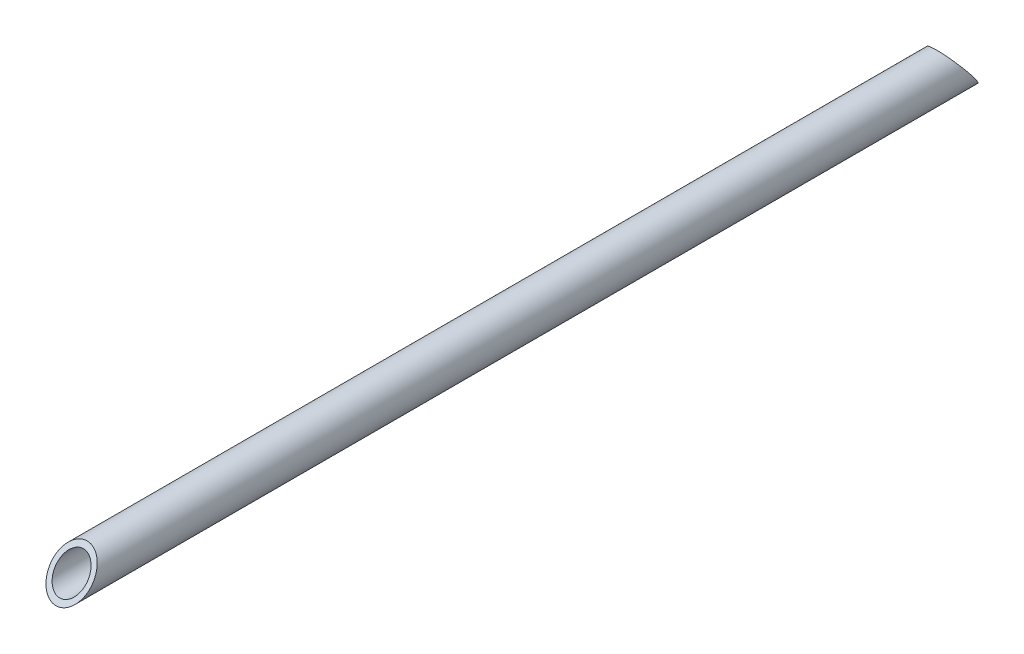
ISO-10303-21;
HEADER;
FILE_DESCRIPTION(('STEP AP214'),'2;1');
FILE_NAME('part.step','',(''),(''),'','','');
FILE_SCHEMA(('AUTOMOTIVE_DESIGN { 1 0 10303 214 1 1 1 1 }'));
ENDSEC;
DATA;
#1=APPLICATION_CONTEXT('core data for automotive mechanical design processes');
#2=APPLICATION_PROTOCOL_DEFINITION('international standard','automotive_design',2000,#1);
#3=PRODUCT_CONTEXT('',#1,'mechanical');
#4=PRODUCT('Part','Part','',(#3));
#5=PRODUCT_RELATED_PRODUCT_CATEGORY('part','',(#4));
#6=PRODUCT_DEFINITION_FORMATION('','',#4);
#7=PRODUCT_DEFINITION_CONTEXT('part definition',#1,'design');
#8=PRODUCT_DEFINITION('design','',#6,#7);
#9=PRODUCT_DEFINITION_SHAPE('','',#8);
#10=(LENGTH_UNIT() NAMED_UNIT(*) SI_UNIT(.MILLI.,.METRE.));
#11=(NAMED_UNIT(*) PLANE_ANGLE_UNIT() SI_UNIT($,.RADIAN.));
#12=(NAMED_UNIT(*) SI_UNIT($,.STERADIAN.) SOLID_ANGLE_UNIT());
#13=UNCERTAINTY_MEASURE_WITH_UNIT(LENGTH_MEASURE(1.E-05),#10,'distance_accuracy_value','');
#14=(GEOMETRIC_REPRESENTATION_CONTEXT(3) GLOBAL_UNCERTAINTY_ASSIGNED_CONTEXT((#13)) GLOBAL_UNIT_ASSIGNED_CONTEXT((#10,
#11,#12)) REPRESENTATION_CONTEXT('',''));
#15=CARTESIAN_POINT('',(0.,0.,0.));
#16=DIRECTION('',(0.,0.,1.));
#17=DIRECTION('',(1.,0.,0.));
#18=AXIS2_PLACEMENT_3D('',#15,#16,#17);
#19=CARTESIAN_POINT('',(1799.99999999996,-4.18286707223905E-12,275.));
#20=DIRECTION('',(0.,0.,-1.));
#21=DIRECTION('',(-1.,0.,0.));
#22=AXIS2_PLACEMENT_3D('',#19,#20,#21);
#23=CYLINDRICAL_SURFACE('',#22,9.65000000000003);
#24=CARTESIAN_POINT('',(1799.99999999996,-4.18286707223905E-12,275.));
#25=DIRECTION('',(0.,-0.607627934708573,-0.79422181596944));
#26=DIRECTION('',(0.,0.79422181596944,-0.607627934708573));
#27=AXIS2_PLACEMENT_3D('',#24,#25,#26);
#28=ELLIPSE('',#27,12.1502580336717,9.65000000000003);
#29=CARTESIAN_POINT('',(1799.99999999996,9.64999999999585,267.617163804824));
#30=VERTEX_POINT('',#29);
#31=EDGE_CURVE('E45',#30,#30,#28,.T.);
#32=ORIENTED_EDGE('',*,*,#31,.F.);
#33=EDGE_LOOP('',(#32));
#34=FACE_BOUND('',#33,.T.);
#35=CARTESIAN_POINT('',(1799.99999999996,-4.18286707223905E-12,-275.000000000001));
#36=DIRECTION('',(0.,-0.607627934708573,0.794221815969439));
#37=DIRECTION('',(0.,-0.794221815969439,-0.607627934708573));
#38=AXIS2_PLACEMENT_3D('',#35,#36,#37);
#39=ELLIPSE('',#38,12.1502580336717,9.65000000000003);
#40=CARTESIAN_POINT('',(1799.99999999996,-9.65000000000421,-282.382836195177));
#41=VERTEX_POINT('',#40);
#42=EDGE_CURVE('E58',#41,#41,#39,.T.);
#43=ORIENTED_EDGE('',*,*,#42,.F.);
#44=EDGE_LOOP('',(#43));
#45=FACE_BOUND('',#44,.T.);
#46=ADVANCED_FACE('F38',(#34,#45),#23,.F.);
#47=CARTESIAN_POINT('',(1799.99999999996,-3.99647548572801E-12,-275.000000000001));
#48=DIRECTION('',(0.,-0.607627934708573,0.794221815969439));
#49=DIRECTION('',(0.,-0.794221815969439,-0.607627934708573));
#50=AXIS2_PLACEMENT_3D('',#47,#48,#49);
#51=PLANE('',#50);
#52=ORIENTED_EDGE('',*,*,#42,.T.);
#53=EDGE_LOOP('',(#52));
#54=FACE_BOUND('',#53,.T.);
#55=CARTESIAN_POINT('',(1799.99999999996,-4.18286707223905E-12,-275.000000000001));
#56=DIRECTION('',(0.,-0.607627934708573,0.794221815969439));
#57=DIRECTION('',(0.,-0.794221815969439,-0.607627934708573));
#58=AXIS2_PLACEMENT_3D('',#55,#56,#57);
#59=ELLIPSE('',#58,15.9904950287701,12.7000000000001);
#60=CARTESIAN_POINT('',(1799.99999999996,-12.7000000000043,-284.7162714693));
#61=VERTEX_POINT('',#60);
#62=EDGE_CURVE('E51',#61,#61,#59,.T.);
#63=ORIENTED_EDGE('',*,*,#62,.F.);
#64=EDGE_LOOP('',(#63));
#65=FACE_BOUND('',#64,.T.);
#66=ADVANCED_FACE('F65',(#54,#65),#51,.F.);
#67=CARTESIAN_POINT('',(1799.99999999996,-4.18286707223905E-12,275.));
#68=DIRECTION('',(0.,0.,-1.));
#69=DIRECTION('',(-1.,0.,0.));
#70=AXIS2_PLACEMENT_3D('',#67,#68,#69);
#71=CYLINDRICAL_SURFACE('',#70,12.7000000000001);
#72=CARTESIAN_POINT('',(1799.99999999996,-4.18286707223905E-12,275.));
#73=DIRECTION('',(0.,-0.607627934708573,-0.79422181596944));
#74=DIRECTION('',(0.,0.79422181596944,-0.607627934708573));
#75=AXIS2_PLACEMENT_3D('',#72,#73,#74);
#76=ELLIPSE('',#75,15.9904950287701,12.7000000000001);
#77=CARTESIAN_POINT('',(1799.99999999996,12.6999999999959,265.283728530701));
#78=VERTEX_POINT('',#77);
#79=EDGE_CURVE('E10',#78,#78,#76,.T.);
#80=ORIENTED_EDGE('',*,*,#79,.T.);
#81=EDGE_LOOP('',(#80));
#82=FACE_BOUND('',#81,.T.);
#83=ORIENTED_EDGE('',*,*,#62,.T.);
#84=EDGE_LOOP('',(#83));
#85=FACE_BOUND('',#84,.T.);
#86=ADVANCED_FACE('F74',(#82,#85),#71,.T.);
#87=CARTESIAN_POINT('',(1799.99999999996,-4.16280375544669E-12,275.));
#88=DIRECTION('',(0.,-0.607627934708573,-0.79422181596944));
#89=DIRECTION('',(0.,0.79422181596944,-0.607627934708573));
#90=AXIS2_PLACEMENT_3D('',#87,#88,#89);
#91=PLANE('',#90);
#92=ORIENTED_EDGE('',*,*,#31,.T.);
#93=EDGE_LOOP('',(#92));
#94=FACE_BOUND('',#93,.T.);
#95=ORIENTED_EDGE('',*,*,#79,.F.);
#96=EDGE_LOOP('',(#95));
#97=FACE_BOUND('',#96,.T.);
#98=ADVANCED_FACE('F80',(#94,#97),#91,.F.);
#99=CLOSED_SHELL('',(#46,#66,#86,#98));
#100=MANIFOLD_SOLID_BREP('B2',#99);
#101=ADVANCED_BREP_SHAPE_REPRESENTATION('',(#18,#100),#14);
#102=SHAPE_DEFINITION_REPRESENTATION(#9,#101);
ENDSEC;
END-ISO-10303-21;
